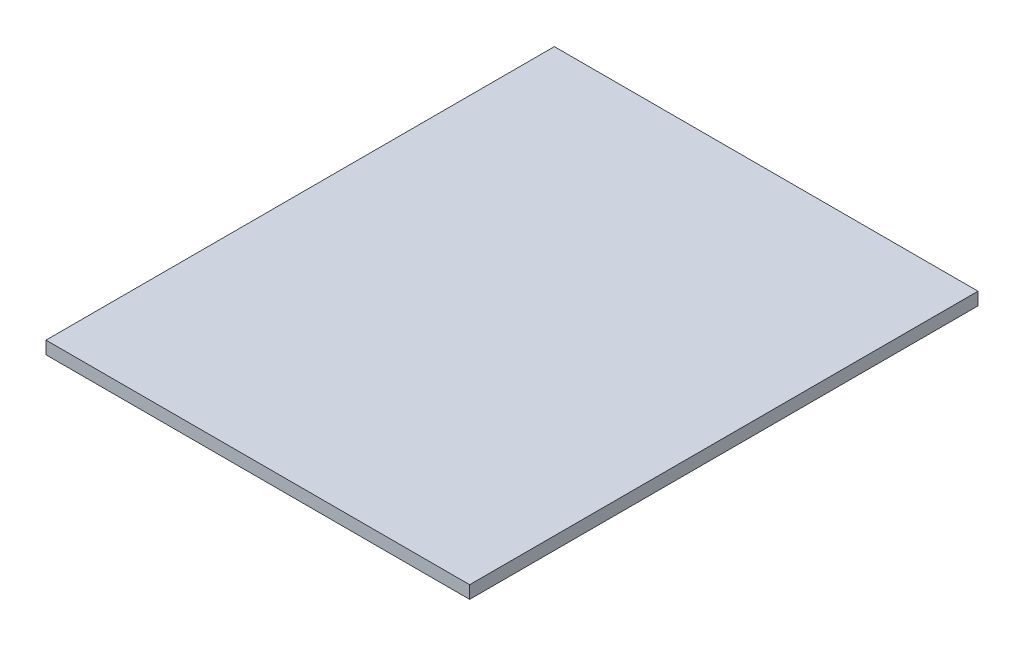
ISO-10303-21;
HEADER;
FILE_DESCRIPTION(('STEP AP214'),'2;1');
FILE_NAME('part.step','',(''),(''),'','','');
FILE_SCHEMA(('AUTOMOTIVE_DESIGN { 1 0 10303 214 1 1 1 1 }'));
ENDSEC;
DATA;
#1=APPLICATION_CONTEXT('core data for automotive mechanical design processes');
#2=APPLICATION_PROTOCOL_DEFINITION('international standard','automotive_design',2000,#1);
#3=PRODUCT_CONTEXT('',#1,'mechanical');
#4=PRODUCT('Part','Part','',(#3));
#5=PRODUCT_RELATED_PRODUCT_CATEGORY('part','',(#4));
#6=PRODUCT_DEFINITION_FORMATION('','',#4);
#7=PRODUCT_DEFINITION_CONTEXT('part definition',#1,'design');
#8=PRODUCT_DEFINITION('design','',#6,#7);
#9=PRODUCT_DEFINITION_SHAPE('','',#8);
#10=(LENGTH_UNIT() NAMED_UNIT(*) SI_UNIT(.MILLI.,.METRE.));
#11=(NAMED_UNIT(*) PLANE_ANGLE_UNIT() SI_UNIT($,.RADIAN.));
#12=(NAMED_UNIT(*) SI_UNIT($,.STERADIAN.) SOLID_ANGLE_UNIT());
#13=UNCERTAINTY_MEASURE_WITH_UNIT(LENGTH_MEASURE(1.E-05),#10,'distance_accuracy_value','');
#14=(GEOMETRIC_REPRESENTATION_CONTEXT(3) GLOBAL_UNCERTAINTY_ASSIGNED_CONTEXT((#13)) GLOBAL_UNIT_ASSIGNED_CONTEXT((#10,
#11,#12)) REPRESENTATION_CONTEXT('',''));
#15=CARTESIAN_POINT('',(0.,0.,0.));
#16=DIRECTION('',(0.,0.,1.));
#17=DIRECTION('',(1.,0.,0.));
#18=AXIS2_PLACEMENT_3D('',#15,#16,#17);
#19=CARTESIAN_POINT('',(-190.5,11.4554,-228.6));
#20=DIRECTION('',(1.,0.,0.));
#21=DIRECTION('',(0.,0.,-1.));
#22=AXIS2_PLACEMENT_3D('',#19,#20,#21);
#23=PLANE('',#22);
#24=DIRECTION('',(0.,0.,1.));
#25=VECTOR('',#24,1.);
#26=CARTESIAN_POINT('',(-190.5,0.,-228.6));
#27=LINE('',#26,#25);
#28=CARTESIAN_POINT('',(-190.5,0.,-228.6));
#29=VERTEX_POINT('',#28);
#30=CARTESIAN_POINT('',(-190.5,0.,228.6));
#31=VERTEX_POINT('',#30);
#32=EDGE_CURVE('E95',#29,#31,#27,.T.);
#33=ORIENTED_EDGE('',*,*,#32,.T.);
#34=DIRECTION('',(0.,-1.,0.));
#35=VECTOR('',#34,1.);
#36=CARTESIAN_POINT('',(-190.5,11.4554,228.6));
#37=LINE('',#36,#35);
#38=CARTESIAN_POINT('',(-190.5,11.4554,228.6));
#39=VERTEX_POINT('',#38);
#40=EDGE_CURVE('E11',#39,#31,#37,.T.);
#41=ORIENTED_EDGE('',*,*,#40,.F.);
#42=DIRECTION('',(0.,0.,1.));
#43=VECTOR('',#42,1.);
#44=CARTESIAN_POINT('',(-190.5,11.4554,-228.6));
#45=LINE('',#44,#43);
#46=CARTESIAN_POINT('',(-190.5,11.4554,-228.6));
#47=VERTEX_POINT('',#46);
#48=EDGE_CURVE('E81',#47,#39,#45,.T.);
#49=ORIENTED_EDGE('',*,*,#48,.F.);
#50=DIRECTION('',(0.,-1.,0.));
#51=VECTOR('',#50,1.);
#52=CARTESIAN_POINT('',(-190.5,11.4554,-228.6));
#53=LINE('',#52,#51);
#54=EDGE_CURVE('E48',#47,#29,#53,.T.);
#55=ORIENTED_EDGE('',*,*,#54,.T.);
#56=EDGE_LOOP('',(#33,#41,#49,#55));
#57=FACE_BOUND('',#56,.T.);
#58=ADVANCED_FACE('F32',(#57),#23,.F.);
#59=CARTESIAN_POINT('',(-190.5,11.4554,228.6));
#60=DIRECTION('',(0.,0.,-1.));
#61=DIRECTION('',(-1.,0.,0.));
#62=AXIS2_PLACEMENT_3D('',#59,#60,#61);
#63=PLANE('',#62);
#64=DIRECTION('',(1.,0.,0.));
#65=VECTOR('',#64,1.);
#66=CARTESIAN_POINT('',(-190.5,0.,228.6));
#67=LINE('',#66,#65);
#68=CARTESIAN_POINT('',(190.5,0.,228.6));
#69=VERTEX_POINT('',#68);
#70=EDGE_CURVE('E86',#31,#69,#67,.T.);
#71=ORIENTED_EDGE('',*,*,#70,.T.);
#72=DIRECTION('',(0.,-1.,0.));
#73=VECTOR('',#72,1.);
#74=CARTESIAN_POINT('',(190.5,11.4554,228.6));
#75=LINE('',#74,#73);
#76=CARTESIAN_POINT('',(190.5,11.4554,228.6));
#77=VERTEX_POINT('',#76);
#78=EDGE_CURVE('E40',#77,#69,#75,.T.);
#79=ORIENTED_EDGE('',*,*,#78,.F.);
#80=DIRECTION('',(1.,0.,0.));
#81=VECTOR('',#80,1.);
#82=CARTESIAN_POINT('',(-190.5,11.4554,228.6));
#83=LINE('',#82,#81);
#84=EDGE_CURVE('E73',#39,#77,#83,.T.);
#85=ORIENTED_EDGE('',*,*,#84,.F.);
#86=ORIENTED_EDGE('',*,*,#40,.T.);
#87=EDGE_LOOP('',(#71,#79,#85,#86));
#88=FACE_BOUND('',#87,.T.);
#89=ADVANCED_FACE('F85',(#88),#63,.F.);
#90=CARTESIAN_POINT('',(190.5,11.4554,-228.6));
#91=DIRECTION('',(1.,0.,0.));
#92=DIRECTION('',(0.,0.,-1.));
#93=AXIS2_PLACEMENT_3D('',#90,#91,#92);
#94=PLANE('',#93);
#95=DIRECTION('',(0.,0.,1.));
#96=VECTOR('',#95,1.);
#97=CARTESIAN_POINT('',(190.5,0.,-228.6));
#98=LINE('',#97,#96);
#99=CARTESIAN_POINT('',(190.5,0.,-228.6));
#100=VERTEX_POINT('',#99);
#101=EDGE_CURVE('E98',#100,#69,#98,.T.);
#102=ORIENTED_EDGE('',*,*,#101,.F.);
#103=DIRECTION('',(0.,-1.,0.));
#104=VECTOR('',#103,1.);
#105=CARTESIAN_POINT('',(190.5,11.4554,-228.6));
#106=LINE('',#105,#104);
#107=CARTESIAN_POINT('',(190.5,11.4554,-228.6));
#108=VERTEX_POINT('',#107);
#109=EDGE_CURVE('E62',#108,#100,#106,.T.);
#110=ORIENTED_EDGE('',*,*,#109,.F.);
#111=DIRECTION('',(0.,0.,1.));
#112=VECTOR('',#111,1.);
#113=CARTESIAN_POINT('',(190.5,11.4554,-228.6));
#114=LINE('',#113,#112);
#115=EDGE_CURVE('E80',#108,#77,#114,.T.);
#116=ORIENTED_EDGE('',*,*,#115,.T.);
#117=ORIENTED_EDGE('',*,*,#78,.T.);
#118=EDGE_LOOP('',(#102,#110,#116,#117));
#119=FACE_BOUND('',#118,.T.);
#120=ADVANCED_FACE('F89',(#119),#94,.T.);
#121=CARTESIAN_POINT('',(-190.5,11.4554,-228.6));
#122=DIRECTION('',(0.,0.,-1.));
#123=DIRECTION('',(-1.,0.,0.));
#124=AXIS2_PLACEMENT_3D('',#121,#122,#123);
#125=PLANE('',#124);
#126=DIRECTION('',(1.,0.,0.));
#127=VECTOR('',#126,1.);
#128=CARTESIAN_POINT('',(-190.5,0.,-228.6));
#129=LINE('',#128,#127);
#130=EDGE_CURVE('E100',#29,#100,#129,.T.);
#131=ORIENTED_EDGE('',*,*,#130,.F.);
#132=ORIENTED_EDGE('',*,*,#54,.F.);
#133=DIRECTION('',(1.,0.,0.));
#134=VECTOR('',#133,1.);
#135=CARTESIAN_POINT('',(-190.5,11.4554,-228.6));
#136=LINE('',#135,#134);
#137=EDGE_CURVE('E90',#47,#108,#136,.T.);
#138=ORIENTED_EDGE('',*,*,#137,.T.);
#139=ORIENTED_EDGE('',*,*,#109,.T.);
#140=EDGE_LOOP('',(#131,#132,#138,#139));
#141=FACE_BOUND('',#140,.T.);
#142=ADVANCED_FACE('F106',(#141),#125,.T.);
#143=CARTESIAN_POINT('',(0.,11.4554,0.));
#144=DIRECTION('',(0.,1.,0.));
#145=DIRECTION('',(0.,0.,1.));
#146=AXIS2_PLACEMENT_3D('',#143,#144,#145);
#147=PLANE('',#146);
#148=ORIENTED_EDGE('',*,*,#48,.T.);
#149=ORIENTED_EDGE('',*,*,#84,.T.);
#150=ORIENTED_EDGE('',*,*,#115,.F.);
#151=ORIENTED_EDGE('',*,*,#137,.F.);
#152=EDGE_LOOP('',(#148,#149,#150,#151));
#153=FACE_BOUND('',#152,.T.);
#154=ADVANCED_FACE('F77',(#153),#147,.T.);
#155=CARTESIAN_POINT('',(0.,0.,0.));
#156=DIRECTION('',(0.,1.,0.));
#157=DIRECTION('',(0.,0.,1.));
#158=AXIS2_PLACEMENT_3D('',#155,#156,#157);
#159=PLANE('',#158);
#160=ORIENTED_EDGE('',*,*,#32,.F.);
#161=ORIENTED_EDGE('',*,*,#130,.T.);
#162=ORIENTED_EDGE('',*,*,#101,.T.);
#163=ORIENTED_EDGE('',*,*,#70,.F.);
#164=EDGE_LOOP('',(#160,#161,#162,#163));
#165=FACE_BOUND('',#164,.T.);
#166=ADVANCED_FACE('F105',(#165),#159,.F.);
#167=CLOSED_SHELL('',(#58,#89,#120,#142,#154,#166));
#168=MANIFOLD_SOLID_BREP('B2',#167);
#169=ADVANCED_BREP_SHAPE_REPRESENTATION('',(#18,#168),#14);
#170=SHAPE_DEFINITION_REPRESENTATION(#9,#169);
ENDSEC;
END-ISO-10303-21;
